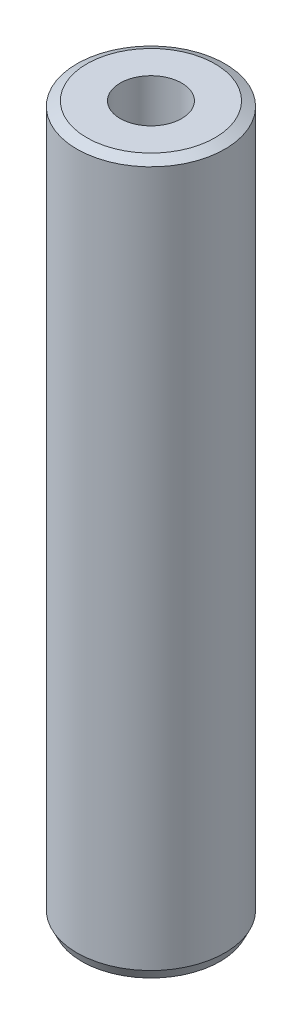
ISO-10303-21;
HEADER;
FILE_DESCRIPTION(('STEP AP214'),'2;1');
FILE_NAME('part.step','',(''),(''),'','','');
FILE_SCHEMA(('AUTOMOTIVE_DESIGN { 1 0 10303 214 1 1 1 1 }'));
ENDSEC;
DATA;
#1=APPLICATION_CONTEXT('core data for automotive mechanical design processes');
#2=APPLICATION_PROTOCOL_DEFINITION('international standard','automotive_design',2000,#1);
#3=PRODUCT_CONTEXT('',#1,'mechanical');
#4=PRODUCT('Part','Part','',(#3));
#5=PRODUCT_RELATED_PRODUCT_CATEGORY('part','',(#4));
#6=PRODUCT_DEFINITION_FORMATION('','',#4);
#7=PRODUCT_DEFINITION_CONTEXT('part definition',#1,'design');
#8=PRODUCT_DEFINITION('design','',#6,#7);
#9=PRODUCT_DEFINITION_SHAPE('','',#8);
#10=(LENGTH_UNIT() NAMED_UNIT(*) SI_UNIT(.MILLI.,.METRE.));
#11=(NAMED_UNIT(*) PLANE_ANGLE_UNIT() SI_UNIT($,.RADIAN.));
#12=(NAMED_UNIT(*) SI_UNIT($,.STERADIAN.) SOLID_ANGLE_UNIT());
#13=UNCERTAINTY_MEASURE_WITH_UNIT(LENGTH_MEASURE(1.E-05),#10,'distance_accuracy_value','');
#14=(GEOMETRIC_REPRESENTATION_CONTEXT(3) GLOBAL_UNCERTAINTY_ASSIGNED_CONTEXT((#13)) GLOBAL_UNIT_ASSIGNED_CONTEXT((#10,
#11,#12)) REPRESENTATION_CONTEXT('',''));
#15=CARTESIAN_POINT('',(0.,0.,0.));
#16=DIRECTION('',(0.,0.,1.));
#17=DIRECTION('',(1.,0.,0.));
#18=AXIS2_PLACEMENT_3D('',#15,#16,#17);
#19=CARTESIAN_POINT('',(0.,432.185531785274,0.));
#20=DIRECTION('',(0.,-1.,0.));
#21=DIRECTION('',(0.,0.,-1.));
#22=AXIS2_PLACEMENT_3D('',#19,#20,#21);
#23=CYLINDRICAL_SURFACE('',#22,45.);
#24=CARTESIAN_POINT('',(0.,429.21549476483,0.));
#25=DIRECTION('',(0.,1.,0.));
#26=DIRECTION('',(0.,0.,1.));
#27=AXIS2_PLACEMENT_3D('',#24,#25,#26);
#28=CIRCLE('',#27,45.);
#29=CARTESIAN_POINT('',(0.,429.21549476483,45.));
#30=VERTEX_POINT('',#29);
#31=EDGE_CURVE('E50',#30,#30,#28,.F.);
#32=ORIENTED_EDGE('',*,*,#31,.T.);
#33=EDGE_LOOP('',(#32));
#34=FACE_BOUND('',#33,.T.);
#35=CARTESIAN_POINT('',(0.,6.04189776364561,0.));
#36=DIRECTION('',(0.,1.,0.));
#37=DIRECTION('',(0.,0.,1.));
#38=AXIS2_PLACEMENT_3D('',#35,#36,#37);
#39=CIRCLE('',#38,45.);
#40=CARTESIAN_POINT('',(0.,6.04189776364561,45.));
#41=VERTEX_POINT('',#40);
#42=EDGE_CURVE('E51',#41,#41,#39,.T.);
#43=ORIENTED_EDGE('',*,*,#42,.T.);
#44=EDGE_LOOP('',(#43));
#45=FACE_BOUND('',#44,.T.);
#46=ADVANCED_FACE('F39',(#34,#45),#23,.T.);
#47=CARTESIAN_POINT('',(0.,432.185531785274,0.));
#48=DIRECTION('',(0.,1.,0.));
#49=DIRECTION('',(0.,0.,1.));
#50=AXIS2_PLACEMENT_3D('',#47,#48,#49);
#51=PLANE('',#50);
#52=CARTESIAN_POINT('',(0.,432.185531785274,0.));
#53=DIRECTION('',(0.,1.,0.));
#54=DIRECTION('',(0.,0.,1.));
#55=AXIS2_PLACEMENT_3D('',#52,#53,#54);
#56=CIRCLE('',#55,38.9581022363543);
#57=CARTESIAN_POINT('',(0.,432.185531785274,38.9581022363543));
#58=VERTEX_POINT('',#57);
#59=EDGE_CURVE('E54',#58,#58,#56,.T.);
#60=ORIENTED_EDGE('',*,*,#59,.T.);
#61=EDGE_LOOP('',(#60));
#62=FACE_BOUND('',#61,.T.);
#63=CARTESIAN_POINT('',(0.,432.185531785274,0.));
#64=DIRECTION('',(0.,1.,0.));
#65=DIRECTION('',(0.,0.,1.));
#66=AXIS2_PLACEMENT_3D('',#63,#64,#65);
#67=CIRCLE('',#66,18.7113220585785);
#68=CARTESIAN_POINT('',(0.,432.185531785274,18.7113220585785));
#69=VERTEX_POINT('',#68);
#70=EDGE_CURVE('E58',#69,#69,#67,.T.);
#71=ORIENTED_EDGE('',*,*,#70,.F.);
#72=EDGE_LOOP('',(#71));
#73=FACE_BOUND('',#72,.T.);
#74=ADVANCED_FACE('F69',(#62,#73),#51,.T.);
#75=CARTESIAN_POINT('',(0.,0.,0.));
#76=DIRECTION('',(0.,1.,0.));
#77=DIRECTION('',(0.,0.,1.));
#78=AXIS2_PLACEMENT_3D('',#75,#76,#77);
#79=PLANE('',#78);
#80=CARTESIAN_POINT('',(0.,0.,0.));
#81=DIRECTION('',(0.,1.,0.));
#82=DIRECTION('',(0.,0.,1.));
#83=AXIS2_PLACEMENT_3D('',#80,#81,#82);
#84=CIRCLE('',#83,42.0299629795565);
#85=CARTESIAN_POINT('',(0.,0.,42.0299629795565));
#86=VERTEX_POINT('',#85);
#87=EDGE_CURVE('E10',#86,#86,#84,.F.);
#88=ORIENTED_EDGE('',*,*,#87,.T.);
#89=EDGE_LOOP('',(#88));
#90=FACE_BOUND('',#89,.T.);
#91=CARTESIAN_POINT('',(0.,0.,0.));
#92=DIRECTION('',(0.,1.,0.));
#93=DIRECTION('',(0.,0.,1.));
#94=AXIS2_PLACEMENT_3D('',#91,#92,#93);
#95=CIRCLE('',#94,18.7113220585785);
#96=CARTESIAN_POINT('',(0.,0.,18.7113220585785));
#97=VERTEX_POINT('',#96);
#98=EDGE_CURVE('E63',#97,#97,#95,.T.);
#99=ORIENTED_EDGE('',*,*,#98,.T.);
#100=EDGE_LOOP('',(#99));
#101=FACE_BOUND('',#100,.T.);
#102=ADVANCED_FACE('F75',(#90,#101),#79,.F.);
#103=CARTESIAN_POINT('',(0.,432.185531785274,0.));
#104=DIRECTION('',(0.,-1.,0.));
#105=DIRECTION('',(0.,0.,-1.));
#106=AXIS2_PLACEMENT_3D('',#103,#104,#105);
#107=CYLINDRICAL_SURFACE('',#106,18.7113220585785);
#108=ORIENTED_EDGE('',*,*,#70,.T.);
#109=EDGE_LOOP('',(#108));
#110=FACE_BOUND('',#109,.T.);
#111=ORIENTED_EDGE('',*,*,#98,.F.);
#112=EDGE_LOOP('',(#111));
#113=FACE_BOUND('',#112,.T.);
#114=ADVANCED_FACE('F70',(#110,#113),#107,.F.);
#115=CARTESIAN_POINT('',(0.,432.185531785274,0.));
#116=DIRECTION('',(0.,-1.,0.));
#117=DIRECTION('',(0.,0.,-1.));
#118=AXIS2_PLACEMENT_3D('',#115,#116,#117);
#119=CONICAL_SURFACE('',#118,38.9581022363543,1.11391258803253);
#120=ORIENTED_EDGE('',*,*,#31,.F.);
#121=EDGE_LOOP('',(#120));
#122=FACE_BOUND('',#121,.T.);
#123=ORIENTED_EDGE('',*,*,#59,.F.);
#124=EDGE_LOOP('',(#123));
#125=FACE_BOUND('',#124,.T.);
#126=ADVANCED_FACE('F81',(#122,#125),#119,.T.);
#127=CARTESIAN_POINT('',(0.,6.04189776364561,0.));
#128=DIRECTION('',(0.,1.,0.));
#129=DIRECTION('',(0.,0.,1.));
#130=AXIS2_PLACEMENT_3D('',#127,#128,#129);
#131=CONICAL_SURFACE('',#130,45.,0.456883738762369);
#132=ORIENTED_EDGE('',*,*,#87,.F.);
#133=EDGE_LOOP('',(#132));
#134=FACE_BOUND('',#133,.T.);
#135=ORIENTED_EDGE('',*,*,#42,.F.);
#136=EDGE_LOOP('',(#135));
#137=FACE_BOUND('',#136,.T.);
#138=ADVANCED_FACE('F45',(#134,#137),#131,.T.);
#139=CLOSED_SHELL('',(#46,#74,#102,#114,#126,#138));
#140=MANIFOLD_SOLID_BREP('B2',#139);
#141=ADVANCED_BREP_SHAPE_REPRESENTATION('',(#18,#140),#14);
#142=SHAPE_DEFINITION_REPRESENTATION(#9,#141);
ENDSEC;
END-ISO-10303-21;
